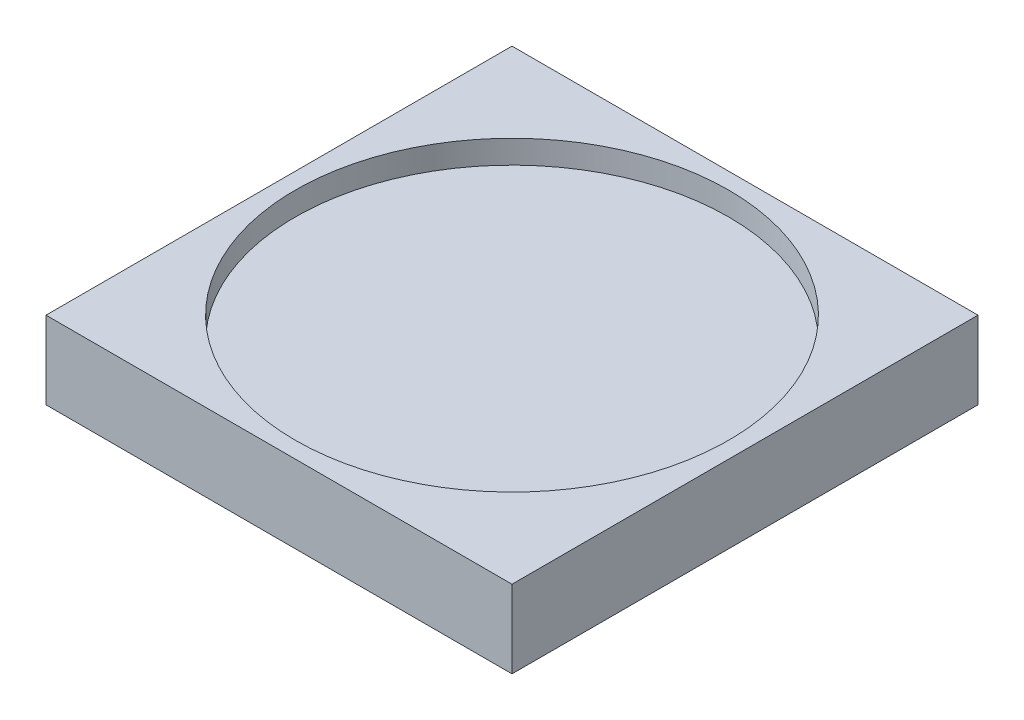
ISO-10303-21;
HEADER;
FILE_DESCRIPTION(('STEP AP214'),'2;1');
FILE_NAME('part.step','',(''),(''),'','','');
FILE_SCHEMA(('AUTOMOTIVE_DESIGN { 1 0 10303 214 1 1 1 1 }'));
ENDSEC;
DATA;
#1=APPLICATION_CONTEXT('core data for automotive mechanical design processes');
#2=APPLICATION_PROTOCOL_DEFINITION('international standard','automotive_design',2000,#1);
#3=PRODUCT_CONTEXT('',#1,'mechanical');
#4=PRODUCT('Part','Part','',(#3));
#5=PRODUCT_RELATED_PRODUCT_CATEGORY('part','',(#4));
#6=PRODUCT_DEFINITION_FORMATION('','',#4);
#7=PRODUCT_DEFINITION_CONTEXT('part definition',#1,'design');
#8=PRODUCT_DEFINITION('design','',#6,#7);
#9=PRODUCT_DEFINITION_SHAPE('','',#8);
#10=(LENGTH_UNIT() NAMED_UNIT(*) SI_UNIT(.MILLI.,.METRE.));
#11=(NAMED_UNIT(*) PLANE_ANGLE_UNIT() SI_UNIT($,.RADIAN.));
#12=(NAMED_UNIT(*) SI_UNIT($,.STERADIAN.) SOLID_ANGLE_UNIT());
#13=UNCERTAINTY_MEASURE_WITH_UNIT(LENGTH_MEASURE(1.E-05),#10,'distance_accuracy_value','');
#14=(GEOMETRIC_REPRESENTATION_CONTEXT(3) GLOBAL_UNCERTAINTY_ASSIGNED_CONTEXT((#13)) GLOBAL_UNIT_ASSIGNED_CONTEXT((#10,
#11,#12)) REPRESENTATION_CONTEXT('',''));
#15=CARTESIAN_POINT('',(0.,0.,0.));
#16=DIRECTION('',(0.,0.,1.));
#17=DIRECTION('',(1.,0.,0.));
#18=AXIS2_PLACEMENT_3D('',#15,#16,#17);
#19=CARTESIAN_POINT('',(15.,5.,15.));
#20=DIRECTION('',(-1.,0.,0.));
#21=DIRECTION('',(0.,0.,1.));
#22=AXIS2_PLACEMENT_3D('',#19,#20,#21);
#23=PLANE('',#22);
#24=DIRECTION('',(0.,0.,-1.));
#25=VECTOR('',#24,1.);
#26=CARTESIAN_POINT('',(15.,0.,15.));
#27=LINE('',#26,#25);
#28=CARTESIAN_POINT('',(15.,0.,15.));
#29=VERTEX_POINT('',#28);
#30=CARTESIAN_POINT('',(15.,0.,-15.));
#31=VERTEX_POINT('',#30);
#32=EDGE_CURVE('E100',#29,#31,#27,.T.);
#33=ORIENTED_EDGE('',*,*,#32,.T.);
#34=DIRECTION('',(0.,-1.,0.));
#35=VECTOR('',#34,1.);
#36=CARTESIAN_POINT('',(15.,5.,-15.));
#37=LINE('',#36,#35);
#38=CARTESIAN_POINT('',(15.,5.,-15.));
#39=VERTEX_POINT('',#38);
#40=EDGE_CURVE('E11',#39,#31,#37,.T.);
#41=ORIENTED_EDGE('',*,*,#40,.F.);
#42=DIRECTION('',(0.,0.,-1.));
#43=VECTOR('',#42,1.);
#44=CARTESIAN_POINT('',(15.,5.,15.));
#45=LINE('',#44,#43);
#46=CARTESIAN_POINT('',(15.,5.,15.));
#47=VERTEX_POINT('',#46);
#48=EDGE_CURVE('E88',#47,#39,#45,.T.);
#49=ORIENTED_EDGE('',*,*,#48,.F.);
#50=DIRECTION('',(0.,-1.,0.));
#51=VECTOR('',#50,1.);
#52=CARTESIAN_POINT('',(15.,5.,15.));
#53=LINE('',#52,#51);
#54=EDGE_CURVE('E96',#47,#29,#53,.T.);
#55=ORIENTED_EDGE('',*,*,#54,.T.);
#56=EDGE_LOOP('',(#33,#41,#49,#55));
#57=FACE_BOUND('',#56,.T.);
#58=ADVANCED_FACE('F37',(#57),#23,.F.);
#59=CARTESIAN_POINT('',(-15.,5.,-15.));
#60=DIRECTION('',(0.,0.,1.));
#61=DIRECTION('',(1.,0.,0.));
#62=AXIS2_PLACEMENT_3D('',#59,#60,#61);
#63=PLANE('',#62);
#64=DIRECTION('',(-1.,0.,0.));
#65=VECTOR('',#64,1.);
#66=CARTESIAN_POINT('',(-15.,0.,-15.));
#67=LINE('',#66,#65);
#68=CARTESIAN_POINT('',(-15.,0.,-15.));
#69=VERTEX_POINT('',#68);
#70=EDGE_CURVE('E92',#31,#69,#67,.T.);
#71=ORIENTED_EDGE('',*,*,#70,.T.);
#72=DIRECTION('',(0.,-1.,0.));
#73=VECTOR('',#72,1.);
#74=CARTESIAN_POINT('',(-15.,5.,-15.));
#75=LINE('',#74,#73);
#76=CARTESIAN_POINT('',(-15.,5.,-15.));
#77=VERTEX_POINT('',#76);
#78=EDGE_CURVE('E45',#77,#69,#75,.T.);
#79=ORIENTED_EDGE('',*,*,#78,.F.);
#80=DIRECTION('',(-1.,0.,0.));
#81=VECTOR('',#80,1.);
#82=CARTESIAN_POINT('',(-15.,5.,-15.));
#83=LINE('',#82,#81);
#84=EDGE_CURVE('E83',#39,#77,#83,.T.);
#85=ORIENTED_EDGE('',*,*,#84,.F.);
#86=ORIENTED_EDGE('',*,*,#40,.T.);
#87=EDGE_LOOP('',(#71,#79,#85,#86));
#88=FACE_BOUND('',#87,.T.);
#89=ADVANCED_FACE('F91',(#88),#63,.F.);
#90=CARTESIAN_POINT('',(-15.,5.,15.));
#91=DIRECTION('',(1.,0.,0.));
#92=DIRECTION('',(0.,0.,-1.));
#93=AXIS2_PLACEMENT_3D('',#90,#91,#92);
#94=PLANE('',#93);
#95=DIRECTION('',(0.,0.,1.));
#96=VECTOR('',#95,1.);
#97=CARTESIAN_POINT('',(-15.,0.,15.));
#98=LINE('',#97,#96);
#99=CARTESIAN_POINT('',(-15.,0.,15.));
#100=VERTEX_POINT('',#99);
#101=EDGE_CURVE('E70',#69,#100,#98,.T.);
#102=ORIENTED_EDGE('',*,*,#101,.T.);
#103=DIRECTION('',(0.,-1.,0.));
#104=VECTOR('',#103,1.);
#105=CARTESIAN_POINT('',(-15.,5.,15.));
#106=LINE('',#105,#104);
#107=CARTESIAN_POINT('',(-15.,5.,15.));
#108=VERTEX_POINT('',#107);
#109=EDGE_CURVE('E93',#108,#100,#106,.T.);
#110=ORIENTED_EDGE('',*,*,#109,.F.);
#111=DIRECTION('',(0.,0.,1.));
#112=VECTOR('',#111,1.);
#113=CARTESIAN_POINT('',(-15.,5.,15.));
#114=LINE('',#113,#112);
#115=EDGE_CURVE('E86',#77,#108,#114,.T.);
#116=ORIENTED_EDGE('',*,*,#115,.F.);
#117=ORIENTED_EDGE('',*,*,#78,.T.);
#118=EDGE_LOOP('',(#102,#110,#116,#117));
#119=FACE_BOUND('',#118,.T.);
#120=ADVANCED_FACE('F94',(#119),#94,.F.);
#121=CARTESIAN_POINT('',(-15.,5.,15.));
#122=DIRECTION('',(0.,0.,-1.));
#123=DIRECTION('',(-1.,0.,0.));
#124=AXIS2_PLACEMENT_3D('',#121,#122,#123);
#125=PLANE('',#124);
#126=DIRECTION('',(1.,0.,0.));
#127=VECTOR('',#126,1.);
#128=CARTESIAN_POINT('',(-15.,0.,15.));
#129=LINE('',#128,#127);
#130=EDGE_CURVE('E76',#100,#29,#129,.T.);
#131=ORIENTED_EDGE('',*,*,#130,.T.);
#132=ORIENTED_EDGE('',*,*,#54,.F.);
#133=DIRECTION('',(1.,0.,0.));
#134=VECTOR('',#133,1.);
#135=CARTESIAN_POINT('',(-15.,5.,15.));
#136=LINE('',#135,#134);
#137=EDGE_CURVE('E53',#108,#47,#136,.T.);
#138=ORIENTED_EDGE('',*,*,#137,.F.);
#139=ORIENTED_EDGE('',*,*,#109,.T.);
#140=EDGE_LOOP('',(#131,#132,#138,#139));
#141=FACE_BOUND('',#140,.T.);
#142=ADVANCED_FACE('F108',(#141),#125,.F.);
#143=CARTESIAN_POINT('',(0.,5.,0.));
#144=DIRECTION('',(0.,-1.,0.));
#145=DIRECTION('',(0.,0.,-1.));
#146=AXIS2_PLACEMENT_3D('',#143,#144,#145);
#147=PLANE('',#146);
#148=CARTESIAN_POINT('',(0.,5.,0.));
#149=DIRECTION('',(0.,1.,0.));
#150=DIRECTION('',(0.,0.,1.));
#151=AXIS2_PLACEMENT_3D('',#148,#149,#150);
#152=CIRCLE('',#151,13.95);
#153=CARTESIAN_POINT('',(0.,5.,13.95));
#154=VERTEX_POINT('',#153);
#155=EDGE_CURVE('E114',#154,#154,#152,.T.);
#156=ORIENTED_EDGE('',*,*,#155,.F.);
#157=EDGE_LOOP('',(#156));
#158=FACE_BOUND('',#157,.T.);
#159=ORIENTED_EDGE('',*,*,#48,.T.);
#160=ORIENTED_EDGE('',*,*,#84,.T.);
#161=ORIENTED_EDGE('',*,*,#115,.T.);
#162=ORIENTED_EDGE('',*,*,#137,.T.);
#163=EDGE_LOOP('',(#159,#160,#161,#162));
#164=FACE_BOUND('',#163,.T.);
#165=ADVANCED_FACE('F84',(#158,#164),#147,.F.);
#166=CARTESIAN_POINT('',(0.,0.,0.));
#167=DIRECTION('',(0.,-1.,0.));
#168=DIRECTION('',(0.,0.,-1.));
#169=AXIS2_PLACEMENT_3D('',#166,#167,#168);
#170=PLANE('',#169);
#171=ORIENTED_EDGE('',*,*,#32,.F.);
#172=ORIENTED_EDGE('',*,*,#130,.F.);
#173=ORIENTED_EDGE('',*,*,#101,.F.);
#174=ORIENTED_EDGE('',*,*,#70,.F.);
#175=EDGE_LOOP('',(#171,#172,#173,#174));
#176=FACE_BOUND('',#175,.T.);
#177=ADVANCED_FACE('F111',(#176),#170,.T.);
#178=CARTESIAN_POINT('',(0.,3.5,0.));
#179=DIRECTION('',(0.,1.,0.));
#180=DIRECTION('',(0.,0.,1.));
#181=AXIS2_PLACEMENT_3D('',#178,#179,#180);
#182=CYLINDRICAL_SURFACE('',#181,13.95);
#183=CARTESIAN_POINT('',(0.,3.5,0.));
#184=DIRECTION('',(0.,1.,0.));
#185=DIRECTION('',(0.,0.,1.));
#186=AXIS2_PLACEMENT_3D('',#183,#184,#185);
#187=CIRCLE('',#186,13.95);
#188=CARTESIAN_POINT('',(0.,3.5,13.95));
#189=VERTEX_POINT('',#188);
#190=EDGE_CURVE('E103',#189,#189,#187,.T.);
#191=ORIENTED_EDGE('',*,*,#190,.F.);
#192=EDGE_LOOP('',(#191));
#193=FACE_BOUND('',#192,.T.);
#194=ORIENTED_EDGE('',*,*,#155,.T.);
#195=EDGE_LOOP('',(#194));
#196=FACE_BOUND('',#195,.T.);
#197=ADVANCED_FACE('F123',(#193,#196),#182,.F.);
#198=CARTESIAN_POINT('',(0.,3.5,0.));
#199=DIRECTION('',(0.,1.,0.));
#200=DIRECTION('',(0.,0.,1.));
#201=AXIS2_PLACEMENT_3D('',#198,#199,#200);
#202=PLANE('',#201);
#203=ORIENTED_EDGE('',*,*,#190,.T.);
#204=EDGE_LOOP('',(#203));
#205=FACE_BOUND('',#204,.T.);
#206=ADVANCED_FACE('F121',(#205),#202,.T.);
#207=CLOSED_SHELL('',(#58,#89,#120,#142,#165,#177,#197,#206));
#208=MANIFOLD_SOLID_BREP('B2',#207);
#209=ADVANCED_BREP_SHAPE_REPRESENTATION('',(#18,#208),#14);
#210=SHAPE_DEFINITION_REPRESENTATION(#9,#209);
ENDSEC;
END-ISO-10303-21;
